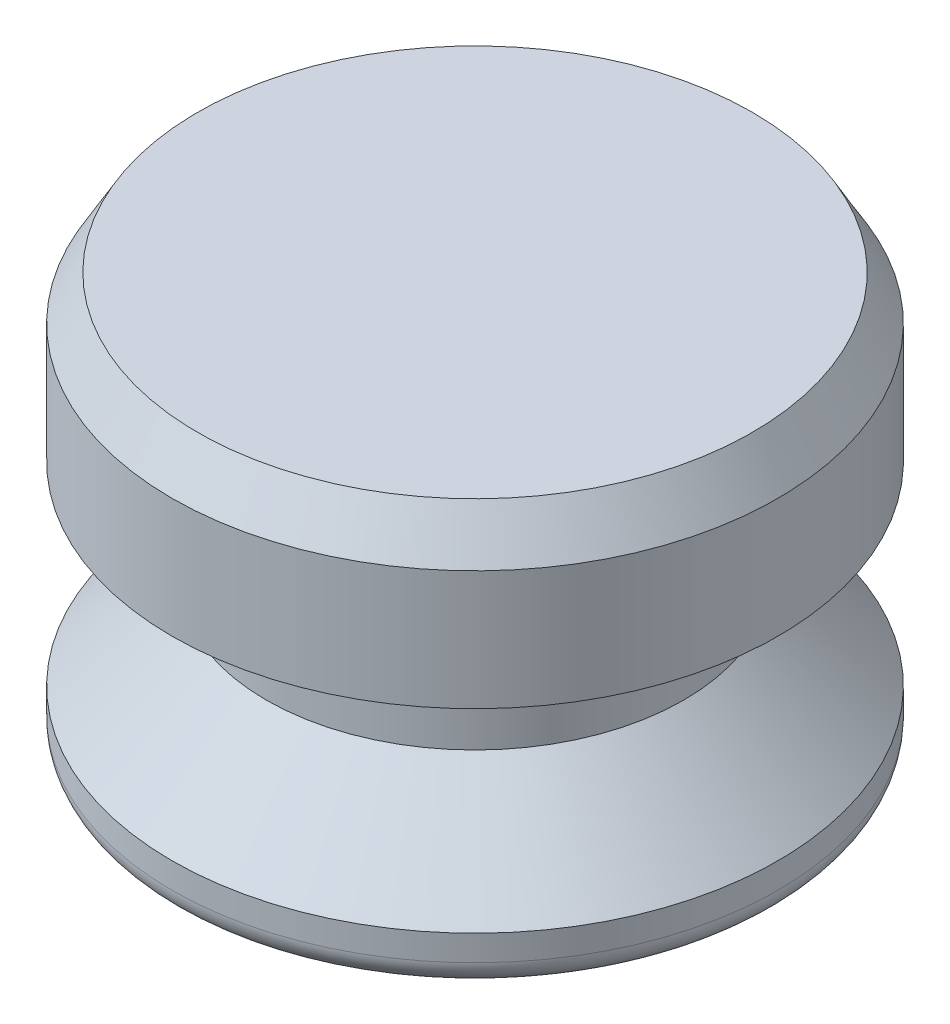
ISO-10303-21;
HEADER;
FILE_DESCRIPTION(('STEP AP214'),'2;1');
FILE_NAME('part.step','',(''),(''),'','','');
FILE_SCHEMA(('AUTOMOTIVE_DESIGN { 1 0 10303 214 1 1 1 1 }'));
ENDSEC;
DATA;
#1=APPLICATION_CONTEXT('core data for automotive mechanical design processes');
#2=APPLICATION_PROTOCOL_DEFINITION('international standard','automotive_design',2000,#1);
#3=PRODUCT_CONTEXT('',#1,'mechanical');
#4=PRODUCT('Part','Part','',(#3));
#5=PRODUCT_RELATED_PRODUCT_CATEGORY('part','',(#4));
#6=PRODUCT_DEFINITION_FORMATION('','',#4);
#7=PRODUCT_DEFINITION_CONTEXT('part definition',#1,'design');
#8=PRODUCT_DEFINITION('design','',#6,#7);
#9=PRODUCT_DEFINITION_SHAPE('','',#8);
#10=(LENGTH_UNIT() NAMED_UNIT(*) SI_UNIT(.MILLI.,.METRE.));
#11=(NAMED_UNIT(*) PLANE_ANGLE_UNIT() SI_UNIT($,.RADIAN.));
#12=(NAMED_UNIT(*) SI_UNIT($,.STERADIAN.) SOLID_ANGLE_UNIT());
#13=UNCERTAINTY_MEASURE_WITH_UNIT(LENGTH_MEASURE(1.E-05),#10,'distance_accuracy_value','');
#14=(GEOMETRIC_REPRESENTATION_CONTEXT(3) GLOBAL_UNCERTAINTY_ASSIGNED_CONTEXT((#13)) GLOBAL_UNIT_ASSIGNED_CONTEXT((#10,
#11,#12)) REPRESENTATION_CONTEXT('',''));
#15=CARTESIAN_POINT('',(0.,0.,0.));
#16=DIRECTION('',(0.,0.,1.));
#17=DIRECTION('',(1.,0.,0.));
#18=AXIS2_PLACEMENT_3D('',#15,#16,#17);
#19=CARTESIAN_POINT('',(0.,0.,0.));
#20=DIRECTION('',(0.,1.,0.));
#21=DIRECTION('',(0.,0.,1.));
#22=AXIS2_PLACEMENT_3D('',#19,#20,#21);
#23=PLANE('',#22);
#24=CARTESIAN_POINT('',(0.,0.,0.));
#25=DIRECTION('',(0.,1.,0.));
#26=DIRECTION('',(0.,0.,1.));
#27=AXIS2_PLACEMENT_3D('',#24,#25,#26);
#28=CIRCLE('',#27,8.60425);
#29=CARTESIAN_POINT('',(0.,0.,8.60425));
#30=VERTEX_POINT('',#29);
#31=EDGE_CURVE('E45',#30,#30,#28,.F.);
#32=ORIENTED_EDGE('',*,*,#31,.T.);
#33=EDGE_LOOP('',(#32));
#34=FACE_BOUND('',#33,.T.);
#35=ADVANCED_FACE('F30',(#34),#23,.F.);
#36=CARTESIAN_POINT('',(0.,0.,0.));
#37=DIRECTION('',(0.,-1.,0.));
#38=DIRECTION('',(0.,0.,-1.));
#39=AXIS2_PLACEMENT_3D('',#36,#37,#38);
#40=CYLINDRICAL_SURFACE('',#39,9.398);
#41=CARTESIAN_POINT('',(0.,0.793749999999999,0.));
#42=DIRECTION('',(0.,1.,0.));
#43=DIRECTION('',(0.,0.,1.));
#44=AXIS2_PLACEMENT_3D('',#41,#42,#43);
#45=CIRCLE('',#44,9.398);
#46=CARTESIAN_POINT('',(0.,0.793749999999999,9.398));
#47=VERTEX_POINT('',#46);
#48=EDGE_CURVE('E41',#47,#47,#45,.T.);
#49=ORIENTED_EDGE('',*,*,#48,.T.);
#50=EDGE_LOOP('',(#49));
#51=FACE_BOUND('',#50,.T.);
#52=CARTESIAN_POINT('',(0.,1.5875,0.));
#53=DIRECTION('',(0.,-1.,0.));
#54=DIRECTION('',(0.,0.,-1.));
#55=AXIS2_PLACEMENT_3D('',#52,#53,#54);
#56=CIRCLE('',#55,9.398);
#57=CARTESIAN_POINT('',(0.,1.5875,-9.398));
#58=VERTEX_POINT('',#57);
#59=EDGE_CURVE('E50',#58,#58,#56,.T.);
#60=ORIENTED_EDGE('',*,*,#59,.T.);
#61=EDGE_LOOP('',(#60));
#62=FACE_BOUND('',#61,.T.);
#63=ADVANCED_FACE('F79',(#51,#62),#40,.T.);
#64=CARTESIAN_POINT('',(0.,4.445,0.));
#65=DIRECTION('',(0.,-1.,0.));
#66=DIRECTION('',(0.,0.,-1.));
#67=AXIS2_PLACEMENT_3D('',#64,#65,#66);
#68=CONICAL_SURFACE('',#67,6.477,0.796386732080182);
#69=ORIENTED_EDGE('',*,*,#59,.F.);
#70=EDGE_LOOP('',(#69));
#71=FACE_BOUND('',#70,.T.);
#72=CARTESIAN_POINT('',(0.,4.445,0.));
#73=DIRECTION('',(0.,-1.,0.));
#74=DIRECTION('',(0.,0.,-1.));
#75=AXIS2_PLACEMENT_3D('',#72,#73,#74);
#76=CIRCLE('',#75,6.477);
#77=CARTESIAN_POINT('',(0.,4.445,-6.477));
#78=VERTEX_POINT('',#77);
#79=EDGE_CURVE('E53',#78,#78,#76,.T.);
#80=ORIENTED_EDGE('',*,*,#79,.T.);
#81=EDGE_LOOP('',(#80));
#82=FACE_BOUND('',#81,.T.);
#83=ADVANCED_FACE('F85',(#71,#82),#68,.T.);
#84=CARTESIAN_POINT('',(0.,0.,0.));
#85=DIRECTION('',(0.,-1.,0.));
#86=DIRECTION('',(0.,0.,-1.));
#87=AXIS2_PLACEMENT_3D('',#84,#85,#86);
#88=CYLINDRICAL_SURFACE('',#87,6.477);
#89=ORIENTED_EDGE('',*,*,#79,.F.);
#90=EDGE_LOOP('',(#89));
#91=FACE_BOUND('',#90,.T.);
#92=CARTESIAN_POINT('',(0.,7.62,0.));
#93=DIRECTION('',(0.,-1.,0.));
#94=DIRECTION('',(0.,0.,-1.));
#95=AXIS2_PLACEMENT_3D('',#92,#93,#94);
#96=CIRCLE('',#95,6.477);
#97=CARTESIAN_POINT('',(0.,7.62,-6.477));
#98=VERTEX_POINT('',#97);
#99=EDGE_CURVE('E56',#98,#98,#96,.T.);
#100=ORIENTED_EDGE('',*,*,#99,.T.);
#101=EDGE_LOOP('',(#100));
#102=FACE_BOUND('',#101,.T.);
#103=ADVANCED_FACE('F75',(#91,#102),#88,.T.);
#104=CARTESIAN_POINT('',(-6.477,7.62,0.));
#105=DIRECTION('',(0.,1.,0.));
#106=DIRECTION('',(0.,0.,1.));
#107=AXIS2_PLACEMENT_3D('',#104,#105,#106);
#108=PLANE('',#107);
#109=ORIENTED_EDGE('',*,*,#99,.F.);
#110=EDGE_LOOP('',(#109));
#111=FACE_BOUND('',#110,.T.);
#112=CARTESIAN_POINT('',(0.,7.62,0.));
#113=DIRECTION('',(0.,-1.,0.));
#114=DIRECTION('',(0.,0.,-1.));
#115=AXIS2_PLACEMENT_3D('',#112,#113,#114);
#116=CIRCLE('',#115,9.398);
#117=CARTESIAN_POINT('',(0.,7.62,-9.398));
#118=VERTEX_POINT('',#117);
#119=EDGE_CURVE('E59',#118,#118,#116,.T.);
#120=ORIENTED_EDGE('',*,*,#119,.T.);
#121=EDGE_LOOP('',(#120));
#122=FACE_BOUND('',#121,.T.);
#123=ADVANCED_FACE('F63',(#111,#122),#108,.F.);
#124=CARTESIAN_POINT('',(0.,0.,0.));
#125=DIRECTION('',(0.,-1.,0.));
#126=DIRECTION('',(0.,0.,-1.));
#127=AXIS2_PLACEMENT_3D('',#124,#125,#126);
#128=CYLINDRICAL_SURFACE('',#127,9.398);
#129=CARTESIAN_POINT('',(0.,11.3251846714922,0.));
#130=DIRECTION('',(0.,-1.,0.));
#131=DIRECTION('',(0.,0.,-1.));
#132=AXIS2_PLACEMENT_3D('',#129,#130,#131);
#133=CIRCLE('',#132,9.398);
#134=CARTESIAN_POINT('',(0.,11.3251846714922,-9.398));
#135=VERTEX_POINT('',#134);
#136=EDGE_CURVE('E37',#135,#135,#133,.T.);
#137=ORIENTED_EDGE('',*,*,#136,.T.);
#138=EDGE_LOOP('',(#137));
#139=FACE_BOUND('',#138,.T.);
#140=ORIENTED_EDGE('',*,*,#119,.F.);
#141=EDGE_LOOP('',(#140));
#142=FACE_BOUND('',#141,.T.);
#143=ADVANCED_FACE('F65',(#139,#142),#128,.T.);
#144=CARTESIAN_POINT('',(-9.398,12.7,0.));
#145=DIRECTION('',(0.,-1.,0.));
#146=DIRECTION('',(0.,0.,-1.));
#147=AXIS2_PLACEMENT_3D('',#144,#145,#146);
#148=PLANE('',#147);
#149=CARTESIAN_POINT('',(0.,12.7,0.));
#150=DIRECTION('',(0.,-1.,0.));
#151=DIRECTION('',(0.,0.,-1.));
#152=AXIS2_PLACEMENT_3D('',#149,#150,#151);
#153=CIRCLE('',#152,8.60424999999999);
#154=CARTESIAN_POINT('',(0.,12.7,-8.60424999999999));
#155=VERTEX_POINT('',#154);
#156=EDGE_CURVE('E10',#155,#155,#153,.F.);
#157=ORIENTED_EDGE('',*,*,#156,.T.);
#158=EDGE_LOOP('',(#157));
#159=FACE_BOUND('',#158,.T.);
#160=ADVANCED_FACE('F67',(#159),#148,.F.);
#161=CARTESIAN_POINT('',(0.,0.793749999999999,0.));
#162=DIRECTION('',(0.,1.,0.));
#163=DIRECTION('',(0.,0.,1.));
#164=AXIS2_PLACEMENT_3D('',#161,#162,#163);
#165=TOROIDAL_SURFACE('',#164,8.60425,0.79375);
#166=ORIENTED_EDGE('',*,*,#48,.F.);
#167=EDGE_LOOP('',(#166));
#168=FACE_BOUND('',#167,.T.);
#169=ORIENTED_EDGE('',*,*,#31,.F.);
#170=EDGE_LOOP('',(#169));
#171=FACE_BOUND('',#170,.T.);
#172=ADVANCED_FACE('F73',(#168,#171),#165,.T.);
#173=CARTESIAN_POINT('',(0.,11.3251846714922,0.));
#174=DIRECTION('',(0.,-1.,0.));
#175=DIRECTION('',(0.,0.,-1.));
#176=AXIS2_PLACEMENT_3D('',#173,#174,#175);
#177=CONICAL_SURFACE('',#176,9.398,0.5235987755983);
#178=ORIENTED_EDGE('',*,*,#156,.F.);
#179=EDGE_LOOP('',(#178));
#180=FACE_BOUND('',#179,.T.);
#181=ORIENTED_EDGE('',*,*,#136,.F.);
#182=EDGE_LOOP('',(#181));
#183=FACE_BOUND('',#182,.T.);
#184=ADVANCED_FACE('F32',(#180,#183),#177,.T.);
#185=CLOSED_SHELL('',(#35,#63,#83,#103,#123,#143,#160,#172,#184));
#186=MANIFOLD_SOLID_BREP('B2',#185);
#187=ADVANCED_BREP_SHAPE_REPRESENTATION('',(#18,#186),#14);
#188=SHAPE_DEFINITION_REPRESENTATION(#9,#187);
ENDSEC;
END-ISO-10303-21;
